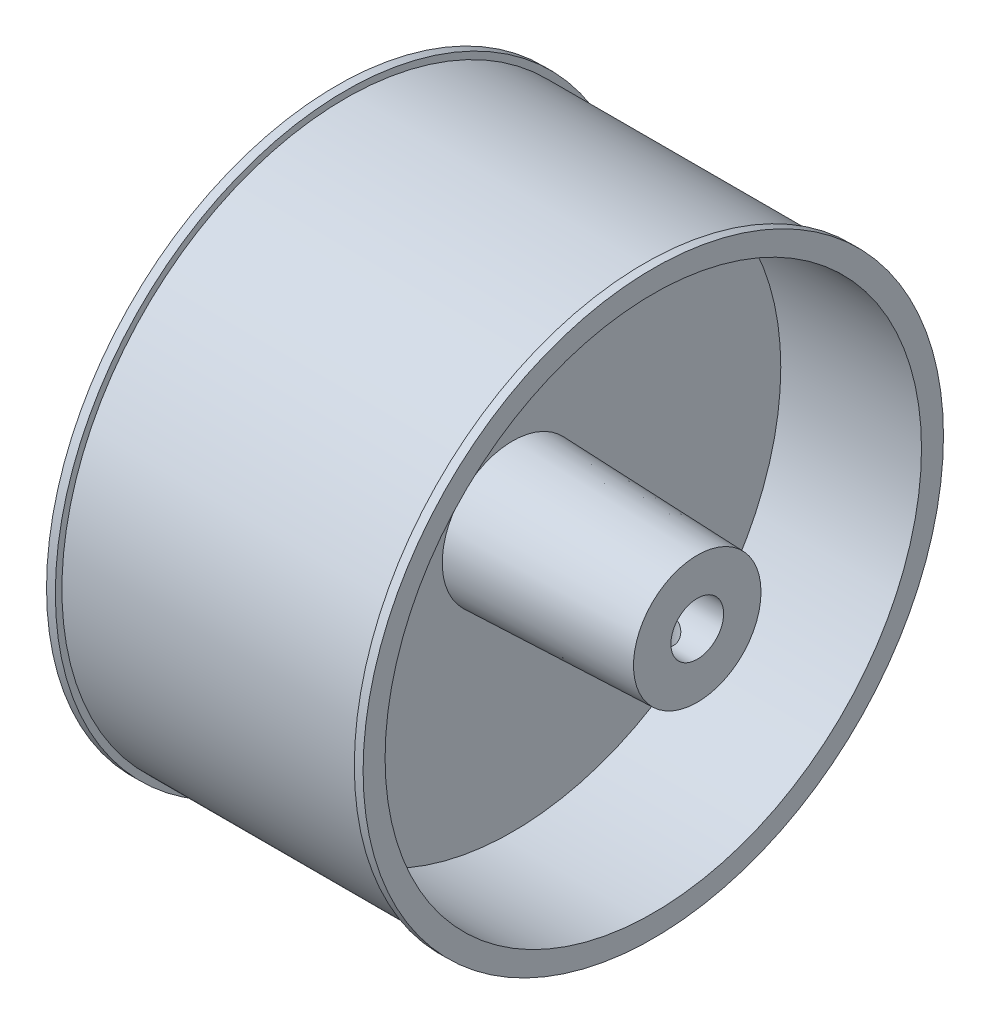
ISO-10303-21;
HEADER;
FILE_DESCRIPTION(('STEP AP214'),'2;1');
FILE_NAME('part.step','',(''),(''),'','','');
FILE_SCHEMA(('AUTOMOTIVE_DESIGN { 1 0 10303 214 1 1 1 1 }'));
ENDSEC;
DATA;
#1=APPLICATION_CONTEXT('core data for automotive mechanical design processes');
#2=APPLICATION_PROTOCOL_DEFINITION('international standard','automotive_design',2000,#1);
#3=PRODUCT_CONTEXT('',#1,'mechanical');
#4=PRODUCT('Part','Part','',(#3));
#5=PRODUCT_RELATED_PRODUCT_CATEGORY('part','',(#4));
#6=PRODUCT_DEFINITION_FORMATION('','',#4);
#7=PRODUCT_DEFINITION_CONTEXT('part definition',#1,'design');
#8=PRODUCT_DEFINITION('design','',#6,#7);
#9=PRODUCT_DEFINITION_SHAPE('','',#8);
#10=(LENGTH_UNIT() NAMED_UNIT(*) SI_UNIT(.MILLI.,.METRE.));
#11=(NAMED_UNIT(*) PLANE_ANGLE_UNIT() SI_UNIT($,.RADIAN.));
#12=(NAMED_UNIT(*) SI_UNIT($,.STERADIAN.) SOLID_ANGLE_UNIT());
#13=UNCERTAINTY_MEASURE_WITH_UNIT(LENGTH_MEASURE(1.E-05),#10,'distance_accuracy_value','');
#14=(GEOMETRIC_REPRESENTATION_CONTEXT(3) GLOBAL_UNCERTAINTY_ASSIGNED_CONTEXT((#13)) GLOBAL_UNIT_ASSIGNED_CONTEXT((#10,
#11,#12)) REPRESENTATION_CONTEXT('',''));
#15=CARTESIAN_POINT('',(0.,0.,0.));
#16=DIRECTION('',(0.,0.,1.));
#17=DIRECTION('',(1.,0.,0.));
#18=AXIS2_PLACEMENT_3D('',#15,#16,#17);
#19=CARTESIAN_POINT('',(36.,0.,0.));
#20=DIRECTION('',(-1.,0.,0.));
#21=DIRECTION('',(0.,0.,1.));
#22=AXIS2_PLACEMENT_3D('',#19,#20,#21);
#23=CYLINDRICAL_SURFACE('',#22,33.);
#24=CARTESIAN_POINT('',(0.,0.,0.));
#25=DIRECTION('',(1.,0.,0.));
#26=DIRECTION('',(0.,0.,-1.));
#27=AXIS2_PLACEMENT_3D('',#24,#25,#26);
#28=CIRCLE('',#27,33.);
#29=CARTESIAN_POINT('',(0.,0.,-33.));
#30=VERTEX_POINT('',#29);
#31=EDGE_CURVE('E52',#30,#30,#28,.T.);
#32=ORIENTED_EDGE('',*,*,#31,.T.);
#33=EDGE_LOOP('',(#32));
#34=FACE_BOUND('',#33,.T.);
#35=CARTESIAN_POINT('',(1.00000000000001,0.,0.));
#36=DIRECTION('',(1.,0.,0.));
#37=DIRECTION('',(0.,0.,-1.));
#38=AXIS2_PLACEMENT_3D('',#35,#36,#37);
#39=CIRCLE('',#38,33.);
#40=CARTESIAN_POINT('',(1.00000000000001,0.,-33.));
#41=VERTEX_POINT('',#40);
#42=EDGE_CURVE('E68',#41,#41,#39,.T.);
#43=ORIENTED_EDGE('',*,*,#42,.F.);
#44=EDGE_LOOP('',(#43));
#45=FACE_BOUND('',#44,.T.);
#46=ADVANCED_FACE('F39',(#34,#45),#23,.T.);
#47=CARTESIAN_POINT('',(20.,0.,0.));
#48=DIRECTION('',(1.,0.,0.));
#49=DIRECTION('',(0.,0.,-1.));
#50=AXIS2_PLACEMENT_3D('',#47,#48,#49);
#51=PLANE('',#50);
#52=CARTESIAN_POINT('',(20.,0.,0.));
#53=DIRECTION('',(1.,0.,0.));
#54=DIRECTION('',(0.,0.,-1.));
#55=AXIS2_PLACEMENT_3D('',#52,#53,#54);
#56=CIRCLE('',#55,30.5);
#57=CARTESIAN_POINT('',(20.,0.,-30.5));
#58=VERTEX_POINT('',#57);
#59=EDGE_CURVE('E57',#58,#58,#56,.T.);
#60=ORIENTED_EDGE('',*,*,#59,.T.);
#61=EDGE_LOOP('',(#60));
#62=FACE_BOUND('',#61,.T.);
#63=CARTESIAN_POINT('',(20.,0.,0.));
#64=DIRECTION('',(1.,0.,0.));
#65=DIRECTION('',(0.,0.,-1.));
#66=AXIS2_PLACEMENT_3D('',#63,#64,#65);
#67=CIRCLE('',#66,8.);
#68=CARTESIAN_POINT('',(20.,0.,-8.));
#69=VERTEX_POINT('',#68);
#70=EDGE_CURVE('E185',#69,#69,#67,.T.);
#71=ORIENTED_EDGE('',*,*,#70,.F.);
#72=EDGE_LOOP('',(#71));
#73=FACE_BOUND('',#72,.T.);
#74=ADVANCED_FACE('F112',(#62,#73),#51,.T.);
#75=CARTESIAN_POINT('',(35.,0.,0.));
#76=DIRECTION('',(1.,0.,0.));
#77=DIRECTION('',(0.,0.,-1.));
#78=AXIS2_PLACEMENT_3D('',#75,#76,#77);
#79=CIRCLE('',#78,33.);
#80=CARTESIAN_POINT('',(35.,0.,-33.));
#81=VERTEX_POINT('',#80);
#82=EDGE_CURVE('E70',#81,#81,#79,.T.);
#83=ORIENTED_EDGE('',*,*,#82,.T.);
#84=EDGE_LOOP('',(#83));
#85=FACE_BOUND('',#84,.T.);
#86=CARTESIAN_POINT('',(36.,0.,0.));
#87=DIRECTION('',(1.,0.,0.));
#88=DIRECTION('',(0.,0.,-1.));
#89=AXIS2_PLACEMENT_3D('',#86,#87,#88);
#90=CIRCLE('',#89,33.);
#91=CARTESIAN_POINT('',(36.,0.,-33.));
#92=VERTEX_POINT('',#91);
#93=EDGE_CURVE('E11',#92,#92,#90,.T.);
#94=ORIENTED_EDGE('',*,*,#93,.F.);
#95=EDGE_LOOP('',(#94));
#96=FACE_BOUND('',#95,.T.);
#97=ADVANCED_FACE('F41',(#85,#96),#23,.T.);
#98=CARTESIAN_POINT('',(36.,0.,0.));
#99=DIRECTION('',(1.,0.,0.));
#100=DIRECTION('',(0.,0.,-1.));
#101=AXIS2_PLACEMENT_3D('',#98,#99,#100);
#102=PLANE('',#101);
#103=CARTESIAN_POINT('',(36.,0.,0.));
#104=DIRECTION('',(1.,0.,0.));
#105=DIRECTION('',(0.,0.,-1.));
#106=AXIS2_PLACEMENT_3D('',#103,#104,#105);
#107=CIRCLE('',#106,30.5);
#108=CARTESIAN_POINT('',(36.,0.,-30.5));
#109=VERTEX_POINT('',#108);
#110=EDGE_CURVE('E60',#109,#109,#107,.T.);
#111=ORIENTED_EDGE('',*,*,#110,.F.);
#112=EDGE_LOOP('',(#111));
#113=FACE_BOUND('',#112,.T.);
#114=ORIENTED_EDGE('',*,*,#93,.T.);
#115=EDGE_LOOP('',(#114));
#116=FACE_BOUND('',#115,.T.);
#117=ADVANCED_FACE('F161',(#113,#116),#102,.T.);
#118=CARTESIAN_POINT('',(0.,0.,0.));
#119=DIRECTION('',(1.,0.,0.));
#120=DIRECTION('',(0.,0.,-1.));
#121=AXIS2_PLACEMENT_3D('',#118,#119,#120);
#122=PLANE('',#121);
#123=CARTESIAN_POINT('',(0.,0.,0.));
#124=DIRECTION('',(-1.,0.,0.));
#125=DIRECTION('',(0.,0.,1.));
#126=AXIS2_PLACEMENT_3D('',#123,#124,#125);
#127=CIRCLE('',#126,30.5);
#128=CARTESIAN_POINT('',(0.,0.,30.5));
#129=VERTEX_POINT('',#128);
#130=EDGE_CURVE('E66',#129,#129,#127,.T.);
#131=ORIENTED_EDGE('',*,*,#130,.F.);
#132=EDGE_LOOP('',(#131));
#133=FACE_BOUND('',#132,.T.);
#134=ORIENTED_EDGE('',*,*,#31,.F.);
#135=EDGE_LOOP('',(#134));
#136=FACE_BOUND('',#135,.T.);
#137=ADVANCED_FACE('F165',(#133,#136),#122,.F.);
#138=CARTESIAN_POINT('',(20.,0.,0.));
#139=DIRECTION('',(1.,0.,0.));
#140=DIRECTION('',(0.,0.,-1.));
#141=AXIS2_PLACEMENT_3D('',#138,#139,#140);
#142=CYLINDRICAL_SURFACE('',#141,30.5);
#143=ORIENTED_EDGE('',*,*,#59,.F.);
#144=EDGE_LOOP('',(#143));
#145=FACE_BOUND('',#144,.T.);
#146=ORIENTED_EDGE('',*,*,#110,.T.);
#147=EDGE_LOOP('',(#146));
#148=FACE_BOUND('',#147,.T.);
#149=ADVANCED_FACE('F172',(#145,#148),#142,.F.);
#150=CARTESIAN_POINT('',(41.,0.,0.));
#151=DIRECTION('',(1.,0.,0.));
#152=DIRECTION('',(0.,0.,-1.));
#153=AXIS2_PLACEMENT_3D('',#150,#151,#152);
#154=PLANE('',#153);
#155=CARTESIAN_POINT('',(41.,0.,0.));
#156=DIRECTION('',(1.,0.,0.));
#157=DIRECTION('',(0.,0.,-1.));
#158=AXIS2_PLACEMENT_3D('',#155,#156,#157);
#159=CIRCLE('',#158,3.);
#160=CARTESIAN_POINT('',(41.,0.,-3.));
#161=VERTEX_POINT('',#160);
#162=EDGE_CURVE('E67',#161,#161,#159,.T.);
#163=ORIENTED_EDGE('',*,*,#162,.F.);
#164=EDGE_LOOP('',(#163));
#165=FACE_BOUND('',#164,.T.);
#166=CARTESIAN_POINT('',(41.,0.,0.));
#167=DIRECTION('',(1.,0.,0.));
#168=DIRECTION('',(0.,0.,-1.));
#169=AXIS2_PLACEMENT_3D('',#166,#167,#168);
#170=CIRCLE('',#169,7.25);
#171=CARTESIAN_POINT('',(41.,0.,-7.25));
#172=VERTEX_POINT('',#171);
#173=EDGE_CURVE('E85',#172,#172,#170,.T.);
#174=ORIENTED_EDGE('',*,*,#173,.T.);
#175=EDGE_LOOP('',(#174));
#176=FACE_BOUND('',#175,.T.);
#177=ADVANCED_FACE('F108',(#165,#176),#154,.T.);
#178=CARTESIAN_POINT('',(41.,0.,0.));
#179=DIRECTION('',(-1.,0.,0.));
#180=DIRECTION('',(0.,0.,1.));
#181=AXIS2_PLACEMENT_3D('',#178,#179,#180);
#182=CONICAL_SURFACE('',#181,7.25,0.035699112679324);
#183=CARTESIAN_POINT('',(34.9139115564366,-7.3268841127038,-1.44160988906889));
#184=CARTESIAN_POINT('',(34.9948900090352,-7.30861598708954,-1.51947725176473));
#185=CARTESIAN_POINT('',(35.0824370447478,-7.2901427519431,-1.59051065285746));
#186=CARTESIAN_POINT('',(35.2684326109351,-7.25456537198428,-1.71701499618818));
#187=CARTESIAN_POINT('',(35.3668859162037,-7.23746183251909,-1.77247908428625));
#188=CARTESIAN_POINT('',(35.5722624381081,-7.20627746632947,-1.86624681757191));
#189=CARTESIAN_POINT('',(35.6791953485028,-7.19220016939011,-1.90453047962079));
#190=CARTESIAN_POINT('',(35.8984437574527,-7.16847982027864,-1.96251120501883));
#191=CARTESIAN_POINT('',(36.010757415611,-7.15883526374885,-1.98221457643011));
#192=CARTESIAN_POINT('',(36.234487729188,-7.14503200926751,-2.00199067515956));
#193=CARTESIAN_POINT('',(36.3458521685961,-7.14073758861968,-2.00255902436107));
#194=CARTESIAN_POINT('',(36.5672048208931,-7.13737744289875,-1.98520099162515));
#195=CARTESIAN_POINT('',(36.6771931576546,-7.13831124375344,-1.96727628667704));
#196=CARTESIAN_POINT('',(36.8900573103031,-7.14487696168932,-1.91410979861814));
#197=CARTESIAN_POINT('',(36.9930382435504,-7.15040098549086,-1.8792732753205));
#198=CARTESIAN_POINT('',(37.1917959310996,-7.16506945829059,-1.7935306914625));
#199=CARTESIAN_POINT('',(37.2875718638659,-7.1742143194051,-1.74262280182576));
#200=CARTESIAN_POINT('',(37.4712459842188,-7.195042757657,-1.62503643080175));
#201=CARTESIAN_POINT('',(37.5589549648342,-7.20677220673199,-1.55807076414448));
#202=CARTESIAN_POINT('',(37.7221381110052,-7.2311188718154,-1.41072534736965));
#203=CARTESIAN_POINT('',(37.7976102365605,-7.24373623534585,-1.33034336514828));
#204=CARTESIAN_POINT('',(37.9362241686809,-7.26862415862599,-1.15590689073395));
#205=CARTESIAN_POINT('',(37.9989820785699,-7.28087640938999,-1.06154414538574));
#206=CARTESIAN_POINT('',(38.1077709342867,-7.30311159522505,-0.863374789968374));
#207=CARTESIAN_POINT('',(38.1538027929929,-7.31309465413347,-0.759568695687346));
#208=CARTESIAN_POINT('',(38.2274722841168,-7.32947572811639,-0.54610922783631));
#209=CARTESIAN_POINT('',(38.2552285757192,-7.33589682641893,-0.436498669023123));
#210=CARTESIAN_POINT('',(38.291896385012,-7.34444315671307,-0.214012195482852));
#211=CARTESIAN_POINT('',(38.3008111163139,-7.34656912127883,-0.101136840928129));
#212=CARTESIAN_POINT('',(38.299511627962,-7.34626227518808,0.12175215346645));
#213=CARTESIAN_POINT('',(38.2897553464874,-7.34393859865368,0.231768909293184));
#214=CARTESIAN_POINT('',(38.2523420042604,-7.33523028078987,0.448543185194616));
#215=CARTESIAN_POINT('',(38.2246848818088,-7.32884562546339,0.55530069403427));
#216=CARTESIAN_POINT('',(38.1523732119713,-7.31278765773064,0.762524963410352));
#217=CARTESIAN_POINT('',(38.1077315938733,-7.30311684747595,0.8629964415512));
#218=CARTESIAN_POINT('',(38.0027461466163,-7.28163295725973,1.05512201896952));
#219=CARTESIAN_POINT('',(37.9423998727728,-7.26981954385409,1.14677474241946));
#220=CARTESIAN_POINT('',(37.8059992822461,-7.24516501736984,1.3210077487828));
#221=CARTESIAN_POINT('',(37.7296036637146,-7.23230607757792,1.40331848008553));
#222=CARTESIAN_POINT('',(37.5640495904114,-7.20746446487947,1.55408781555251));
#223=CARTESIAN_POINT('',(37.4748900783777,-7.19548186468647,1.62254527108375));
#224=CARTESIAN_POINT('',(37.2852737654215,-7.17392819687785,1.74425037868202));
#225=CARTESIAN_POINT('',(37.184720680413,-7.16438030108843,1.79735248453316));
#226=CARTESIAN_POINT('',(36.9758201334215,-7.1493175645189,1.88583668956823));
#227=CARTESIAN_POINT('',(36.8674743969509,-7.14380183390528,1.92122269786426));
#228=CARTESIAN_POINT('',(36.6490354471215,-7.13791952035239,1.97245232768471));
#229=CARTESIAN_POINT('',(36.5390570524326,-7.1374253505198,1.98877079745188));
#230=CARTESIAN_POINT('',(36.318024688454,-7.14164930763689,2.0029834066819));
#231=CARTESIAN_POINT('',(36.2069708576032,-7.14636677231554,2.00087988689292));
#232=CARTESIAN_POINT('',(35.9893374454584,-7.16061338373864,1.97865967340648));
#233=CARTESIAN_POINT('',(35.8827128194809,-7.17004150636109,1.95891458784532));
#234=CARTESIAN_POINT('',(35.6744367513015,-7.19287000078473,1.90264996570584));
#235=CARTESIAN_POINT('',(35.5727859452872,-7.20627087919076,1.86612828945423));
#236=CARTESIAN_POINT('',(35.3749076089276,-7.23617318987544,1.77648746678696));
#237=CARTESIAN_POINT('',(35.2788428840379,-7.2527348874323,1.72302955956));
#238=CARTESIAN_POINT('',(35.0968957272299,-7.28723663166304,1.60127384801731));
#239=CARTESIAN_POINT('',(35.0110155943807,-7.3051769880547,1.53297270280907));
#240=CARTESIAN_POINT('',(34.8487120327183,-7.34142622850591,1.38059328831194));
#241=CARTESIAN_POINT('',(34.7727270746541,-7.35972590285937,1.29604486850646));
#242=CARTESIAN_POINT('',(34.6359852871381,-7.39425344652294,1.11503163347699));
#243=CARTESIAN_POINT('',(34.5752285028784,-7.41048130968454,1.01856678289032));
#244=CARTESIAN_POINT('',(34.4709364566969,-7.43919591516259,0.816533058482657));
#245=CARTESIAN_POINT('',(34.4273559406995,-7.45169246694206,0.710989012615881));
#246=CARTESIAN_POINT('',(34.3587084577977,-7.47169660194676,0.493600125926851));
#247=CARTESIAN_POINT('',(34.3336359468941,-7.47920567908252,0.381757182727269));
#248=CARTESIAN_POINT('',(34.3035281258553,-7.48825509820396,0.159517408594764));
#249=CARTESIAN_POINT('',(34.2977667673481,-7.4900116589328,0.0492274534452949));
#250=CARTESIAN_POINT('',(34.3044544854805,-7.48798749150251,-0.170746930384136));
#251=CARTESIAN_POINT('',(34.3169026292788,-7.48420704699454,-0.280431389793664));
#252=CARTESIAN_POINT('',(34.3591129313282,-7.47162381202368,-0.493783043294513));
#253=CARTESIAN_POINT('',(34.3885207166157,-7.4629238849697,-0.597526990417449));
#254=CARTESIAN_POINT('',(34.463394806931,-7.4414079411785,-0.798557498566907));
#255=CARTESIAN_POINT('',(34.5088574498348,-7.42859286317043,-0.895845526186385));
#256=CARTESIAN_POINT('',(34.6092228202151,-7.40144421783601,-1.07233502464459));
#257=CARTESIAN_POINT('',(34.6627397560524,-7.38738782305706,-1.15237317577051));
#258=CARTESIAN_POINT('',(34.780547642582,-7.35789886335915,-1.30380234104977));
#259=CARTESIAN_POINT('',(34.8448401411515,-7.34246610087833,-1.37519211034717));
#260=CARTESIAN_POINT('',(34.9139115564366,-7.3268841127038,-1.44160988906889));
#261=B_SPLINE_CURVE_WITH_KNOTS('',3,(#183,#184,#185,#186,#187,#188,#189,#190,#191,#192,#193,
#194,#195,#196,#197,#198,#199,#200,#201,#202,#203,#204,#205,#206,#207,#208,#209,#210,#211,#212,
#213,#214,#215,#216,#217,#218,#219,#220,#221,#222,#223,#224,#225,#226,#227,#228,#229,#230,#231,
#232,#233,#234,#235,#236,#237,#238,#239,#240,#241,#242,#243,#244,#245,#246,#247,#248,#249,#250,
#251,#252,#253,#254,#255,#256,#257,#258,#259,#260),.UNSPECIFIED.,.T.,.F.,(4,2,2,2,2,2,2,2,2,2,2,
2,2,2,2,2,2,2,2,2,2,2,2,2,2,2,2,2,2,2,2,2,2,2,2,2,2,2,4),(0.,0.341115530835921,
0.682380997631957,1.02404237959391,1.3655877247286,1.69827960467149,2.03094131806177,
2.35599793858456,2.68109156702846,3.01250133258373,3.34396629061855,3.68429906260903,
4.02461325704527,4.36269548816988,4.70072005142296,5.03056011046939,5.36040130638875,
5.6899919145567,6.019633859573,6.35716324586998,6.6947206066834,7.03537984235615,
7.37596387734283,7.7078720985591,8.03973814722464,8.36477428076175,8.68985188066868,
9.02189263723892,9.35400820656358,9.6977967971539,10.0415864079813,10.3844640872127,
10.7272390170784,11.0569726290376,11.3866893499081,11.7097541109545,12.0327452282569,
12.3236614510479,12.6146194989543),.UNSPECIFIED.);
#262=CARTESIAN_POINT('',(34.9139115564366,-7.3268841127038,-1.44160988906889));
#263=VERTEX_POINT('',#262);
#264=EDGE_CURVE('E116',#263,#263,#261,.T.);
#265=ORIENTED_EDGE('',*,*,#264,.F.);
#266=EDGE_LOOP('',(#265));
#267=FACE_BOUND('',#266,.T.);
#268=ORIENTED_EDGE('',*,*,#173,.F.);
#269=EDGE_LOOP('',(#268));
#270=FACE_BOUND('',#269,.T.);
#271=ORIENTED_EDGE('',*,*,#70,.T.);
#272=EDGE_LOOP('',(#271));
#273=FACE_BOUND('',#272,.T.);
#274=ADVANCED_FACE('F97',(#267,#270,#273),#182,.T.);
#275=CARTESIAN_POINT('',(18.,0.,0.));
#276=DIRECTION('',(-1.,0.,0.));
#277=DIRECTION('',(0.,0.,1.));
#278=AXIS2_PLACEMENT_3D('',#275,#276,#277);
#279=CYLINDRICAL_SURFACE('',#278,30.5);
#280=CARTESIAN_POINT('',(18.,0.,0.));
#281=DIRECTION('',(-1.,0.,0.));
#282=DIRECTION('',(0.,0.,1.));
#283=AXIS2_PLACEMENT_3D('',#280,#281,#282);
#284=CIRCLE('',#283,30.5);
#285=CARTESIAN_POINT('',(18.,0.,30.5));
#286=VERTEX_POINT('',#285);
#287=EDGE_CURVE('E82',#286,#286,#284,.T.);
#288=ORIENTED_EDGE('',*,*,#287,.F.);
#289=EDGE_LOOP('',(#288));
#290=FACE_BOUND('',#289,.T.);
#291=ORIENTED_EDGE('',*,*,#130,.T.);
#292=EDGE_LOOP('',(#291));
#293=FACE_BOUND('',#292,.T.);
#294=ADVANCED_FACE('F107',(#290,#293),#279,.F.);
#295=CARTESIAN_POINT('',(18.,0.,0.));
#296=DIRECTION('',(-1.,0.,0.));
#297=DIRECTION('',(0.,0.,1.));
#298=AXIS2_PLACEMENT_3D('',#295,#296,#297);
#299=PLANE('',#298);
#300=CARTESIAN_POINT('',(18.,0.,0.));
#301=DIRECTION('',(-1.,0.,0.));
#302=DIRECTION('',(0.,0.,1.));
#303=AXIS2_PLACEMENT_3D('',#300,#301,#302);
#304=CIRCLE('',#303,3.);
#305=CARTESIAN_POINT('',(18.,0.,3.));
#306=VERTEX_POINT('',#305);
#307=EDGE_CURVE('E63',#306,#306,#304,.T.);
#308=ORIENTED_EDGE('',*,*,#307,.F.);
#309=EDGE_LOOP('',(#308));
#310=FACE_BOUND('',#309,.T.);
#311=ORIENTED_EDGE('',*,*,#287,.T.);
#312=EDGE_LOOP('',(#311));
#313=FACE_BOUND('',#312,.T.);
#314=ADVANCED_FACE('F143',(#310,#313),#299,.T.);
#315=CARTESIAN_POINT('',(-36.,0.,0.));
#316=DIRECTION('',(1.,0.,0.));
#317=DIRECTION('',(0.,0.,-1.));
#318=AXIS2_PLACEMENT_3D('',#315,#316,#317);
#319=CYLINDRICAL_SURFACE('',#318,3.);
#320=CARTESIAN_POINT('',(36.30018747693,-2.23606797749979,2.));
#321=CARTESIAN_POINT('',(36.2025591660614,-2.23607753462816,1.99999453997731));
#322=CARTESIAN_POINT('',(36.1048967232212,-2.24258071047442,1.99278992503664));
#323=CARTESIAN_POINT('',(35.9130675652792,-2.26731972501617,1.96458268317731));
#324=CARTESIAN_POINT('',(35.8189074414005,-2.2855766081271,1.94355530587863));
#325=CARTESIAN_POINT('',(35.6374520350523,-2.3305658582557,1.88935861676632));
#326=CARTESIAN_POINT('',(35.5500997801924,-2.35721561794601,1.85630718014214));
#327=CARTESIAN_POINT('',(35.3823216445834,-2.41584094681825,1.77934008393539));
#328=CARTESIAN_POINT('',(35.3018972069536,-2.44781762158831,1.73542216812163));
#329=CARTESIAN_POINT('',(35.1365405893131,-2.51946072932026,1.63002410007714));
#330=CARTESIAN_POINT('',(35.0528553592128,-2.55954936090363,1.56687435451733));
#331=CARTESIAN_POINT('',(34.8961847680557,-2.63944827308082,1.4281921974068));
#332=CARTESIAN_POINT('',(34.8232099552715,-2.67925824297985,1.3526477317708));
#333=CARTESIAN_POINT('',(34.6795438181484,-2.76088818523747,1.17815690494296));
#334=CARTESIAN_POINT('',(34.6107049651544,-2.80216785846922,1.07740643965819));
#335=CARTESIAN_POINT('',(34.49154538144,-2.87558484482764,0.862470964212236));
#336=CARTESIAN_POINT('',(34.4412039628988,-2.90773236231037,0.748301152321706));
#337=CARTESIAN_POINT('',(34.3666310759126,-2.95599907464725,0.523249073480003));
#338=CARTESIAN_POINT('',(34.3401041324345,-2.97351175615867,0.413434725181416));
#339=CARTESIAN_POINT('',(34.3060029876464,-2.99609745461921,0.189695448729861));
#340=CARTESIAN_POINT('',(34.2984049177046,-3.00118613762359,0.0757758812858232));
#341=CARTESIAN_POINT('',(34.3023599268791,-2.99855361722953,-0.134147050232332));
#342=CARTESIAN_POINT('',(34.3111765282471,-2.99266264910127,-0.230240638008755));
#343=CARTESIAN_POINT('',(34.3422785282889,-2.9720818279002,-0.419238633271017));
#344=CARTESIAN_POINT('',(34.3645649092336,-2.95739133313102,-0.512142807649725));
#345=CARTESIAN_POINT('',(34.4213831617246,-2.92052091703736,-0.69207793767117));
#346=CARTESIAN_POINT('',(34.4558663621286,-2.89837077982679,-0.779130623845963));
#347=CARTESIAN_POINT('',(34.5357411198829,-2.84821104476287,-0.946209150653558));
#348=CARTESIAN_POINT('',(34.5811346684315,-2.82020037745161,-1.0262337049694));
#349=CARTESIAN_POINT('',(34.6881662143899,-2.75618058450702,-1.18828429196344));
#350=CARTESIAN_POINT('',(34.7511550002828,-2.71960408792025,-1.26919148099708));
#351=CARTESIAN_POINT('',(34.8880861564103,-2.64400601826998,-1.41998807498305));
#352=CARTESIAN_POINT('',(34.9620454228638,-2.60498072815232,-1.48986013519457));
#353=CARTESIAN_POINT('',(35.1321506871433,-2.52150044944151,-1.62772235326165));
#354=CARTESIAN_POINT('',(35.2299585566445,-2.47714320008931,-1.69373593126355));
#355=CARTESIAN_POINT('',(35.4376973161507,-2.39475610831095,-1.80834874945483));
#356=CARTESIAN_POINT('',(35.5476074713439,-2.35671571534889,-1.85697718654898));
#357=CARTESIAN_POINT('',(35.7449065390031,-2.30262870306889,-1.92332724567776));
#358=CARTESIAN_POINT('',(35.8297808469869,-2.28340364577667,-1.94590791747533));
#359=CARTESIAN_POINT('',(36.0032269667469,-2.25409039789612,-1.97979555580014));
#360=CARTESIAN_POINT('',(36.0917920881027,-2.24398636782354,-1.99112206964395));
#361=CARTESIAN_POINT('',(36.2706304633715,-2.23447556987372,-2.00179400148877));
#362=CARTESIAN_POINT('',(36.3609094554502,-2.23511533866469,-2.00108729753098));
#363=CARTESIAN_POINT('',(36.5398713108851,-2.24709880368953,-1.98761629716365));
#364=CARTESIAN_POINT('',(36.6285528210374,-2.2584511764885,-1.97484222690381));
#365=CARTESIAN_POINT('',(36.7975768944799,-2.28927977500747,-1.93899811187046));
#366=CARTESIAN_POINT('',(36.8781151859326,-2.30833187069749,-1.91646174529973));
#367=CARTESIAN_POINT('',(37.0343137129803,-2.35229958533651,-1.86223041628513));
#368=CARTESIAN_POINT('',(37.1099722998931,-2.3772171729463,-1.83053237805351));
#369=CARTESIAN_POINT('',(37.2703894807776,-2.43611483596194,-1.75163346599563));
#370=CARTESIAN_POINT('',(37.3539442884727,-2.47091081434317,-1.70260028818246));
#371=CARTESIAN_POINT('',(37.5126042795473,-2.54262514806634,-1.59352731501438));
#372=CARTESIAN_POINT('',(37.5876989936725,-2.57954604947544,-1.53347411883827));
#373=CARTESIAN_POINT('',(37.7441498243976,-2.66075678321007,-1.38876657712435));
#374=CARTESIAN_POINT('',(37.8232903251784,-2.70489452138573,-1.30160386514206));
#375=CARTESIAN_POINT('',(37.9660041598703,-2.78775581841638,-1.11309948866218));
#376=CARTESIAN_POINT('',(38.0295912481868,-2.82648414789458,-1.011770477457));
#377=CARTESIAN_POINT('',(38.1280792158476,-2.88790821242222,-0.817487474821792));
#378=CARTESIAN_POINT('',(38.1661439813704,-2.91225458111008,-0.726662364886314));
#379=CARTESIAN_POINT('',(38.2287946712505,-2.95278707867041,-0.538757079020509));
#380=CARTESIAN_POINT('',(38.2533919797898,-2.96898009871993,-0.441682263858764));
#381=CARTESIAN_POINT('',(38.2878844407688,-2.99178364026746,-0.243369392303439));
#382=CARTESIAN_POINT('',(38.2977141564367,-2.99835150856533,-0.142114836924314));
#383=CARTESIAN_POINT('',(38.3018353283471,-3.00109821029056,0.0608555465807365));
#384=CARTESIAN_POINT('',(38.2961282288862,-2.99727800938901,0.162571330953452));
#385=CARTESIAN_POINT('',(38.2705279879253,-2.98029555977323,0.35575753252811));
#386=CARTESIAN_POINT('',(38.2516964920682,-2.96783277209856,0.447435143070534));
#387=CARTESIAN_POINT('',(38.2019494674991,-2.93536106206933,0.626018422997066));
#388=CARTESIAN_POINT('',(38.1710320615828,-2.91535096747102,0.712923348686895));
#389=CARTESIAN_POINT('',(38.096248772046,-2.86791765486194,0.885147296608356));
#390=CARTESIAN_POINT('',(38.051737169435,-2.84013248946338,0.970083589200271));
#391=CARTESIAN_POINT('',(37.952036832304,-2.77975408235471,1.13155266268319));
#392=CARTESIAN_POINT('',(37.896841708978,-2.74715796645263,1.20808037205002));
#393=CARTESIAN_POINT('',(37.7675585745937,-2.67392931472394,1.36329422201403));
#394=CARTESIAN_POINT('',(37.691864453256,-2.6328391387737,1.44042679526092));
#395=CARTESIAN_POINT('',(37.5290739353842,-2.55053357649486,1.58160022281596));
#396=CARTESIAN_POINT('',(37.4419690880959,-2.50931811970154,1.64563128323924));
#397=CARTESIAN_POINT('',(37.2643198861747,-2.43384213590298,1.75513253518412));
#398=CARTESIAN_POINT('',(37.1745456669797,-2.39929086741903,1.80164646897211));
#399=CARTESIAN_POINT('',(36.9869030279369,-2.33747501591022,1.88115802340273));
#400=CARTESIAN_POINT('',(36.8890507830679,-2.31019631295304,1.91418190281334));
#401=CARTESIAN_POINT('',(36.7094160085055,-2.27191051929539,1.95936262470908));
#402=CARTESIAN_POINT('',(36.6288792401397,-2.25863695410151,1.97452228373249));
#403=CARTESIAN_POINT('',(36.4656310764255,-2.24071519216008,1.99483915818926));
#404=CARTESIAN_POINT('',(36.3829215326695,-2.23605987841475,2.00000462703716));
#405=CARTESIAN_POINT('',(36.30018747693,-2.23606797749979,2.));
#406=B_SPLINE_CURVE_WITH_KNOTS('',3,(#320,#321,#322,#323,#324,#325,#326,#327,#328,#329,#330,
#331,#332,#333,#334,#335,#336,#337,#338,#339,#340,#341,#342,#343,#344,#345,#346,#347,#348,#349,
#350,#351,#352,#353,#354,#355,#356,#357,#358,#359,#360,#361,#362,#363,#364,#365,#366,#367,#368,
#369,#370,#371,#372,#373,#374,#375,#376,#377,#378,#379,#380,#381,#382,#383,#384,#385,#386,#387,
#388,#389,#390,#391,#392,#393,#394,#395,#396,#397,#398,#399,#400,#401,#402,#403,#404,#405),
.UNSPECIFIED.,.T.,.F.,(4,2,2,2,2,2,2,2,2,2,2,2,2,2,2,2,2,2,2,2,2,2,2,2,2,2,2,2,2,2,2,2,2,2,2,2,
2,2,2,2,2,2,4),(0.,0.29250693072215,0.585539042259287,0.875772651216279,1.16606657266549,
1.50154677068638,1.83735518436275,2.2216703100629,2.6055542938858,2.9463748206358,
3.28676536688299,3.57539534955743,3.86404638283747,4.15155831973192,4.43912276903001,
4.76447525946635,5.09033414796639,5.46678703504945,5.84260469743949,6.11126090401327,
6.37944966235488,6.64880037638039,6.91836943570599,7.17476451706938,7.43124577644959,
7.73899230052354,8.04711556801511,8.42254684520965,8.79764490572583,9.100705806117,
9.40351012888474,9.70765229266166,10.0117661844615,10.2937678224973,10.5758132789284,
10.874178629859,11.1727229593109,11.5182220628452,11.8639785041861,12.1833412579672,
12.5020793664923,12.7501661630426,12.9980479966543),.UNSPECIFIED.);
#407=CARTESIAN_POINT('',(36.30018747693,-2.23606797749979,2.));
#408=VERTEX_POINT('',#407);
#409=EDGE_CURVE('E43',#408,#408,#406,.T.);
#410=ORIENTED_EDGE('',*,*,#409,.T.);
#411=EDGE_LOOP('',(#410));
#412=FACE_BOUND('',#411,.T.);
#413=ORIENTED_EDGE('',*,*,#307,.T.);
#414=EDGE_LOOP('',(#413));
#415=FACE_BOUND('',#414,.T.);
#416=ORIENTED_EDGE('',*,*,#162,.T.);
#417=EDGE_LOOP('',(#416));
#418=FACE_BOUND('',#417,.T.);
#419=ADVANCED_FACE('F138',(#412,#415,#418),#319,.F.);
#420=CARTESIAN_POINT('',(35.,0.,0.));
#421=DIRECTION('',(1.,0.,0.));
#422=DIRECTION('',(0.,0.,-1.));
#423=AXIS2_PLACEMENT_3D('',#420,#421,#422);
#424=PLANE('',#423);
#425=CARTESIAN_POINT('',(35.,0.,0.));
#426=DIRECTION('',(1.,0.,0.));
#427=DIRECTION('',(0.,0.,-1.));
#428=AXIS2_PLACEMENT_3D('',#425,#426,#427);
#429=CIRCLE('',#428,32.25);
#430=CARTESIAN_POINT('',(35.,0.,-32.25));
#431=VERTEX_POINT('',#430);
#432=EDGE_CURVE('E71',#431,#431,#429,.T.);
#433=ORIENTED_EDGE('',*,*,#432,.T.);
#434=EDGE_LOOP('',(#433));
#435=FACE_BOUND('',#434,.T.);
#436=ORIENTED_EDGE('',*,*,#82,.F.);
#437=EDGE_LOOP('',(#436));
#438=FACE_BOUND('',#437,.T.);
#439=ADVANCED_FACE('F132',(#435,#438),#424,.F.);
#440=CARTESIAN_POINT('',(1.00000000000001,0.,0.));
#441=DIRECTION('',(1.,0.,0.));
#442=DIRECTION('',(0.,0.,-1.));
#443=AXIS2_PLACEMENT_3D('',#440,#441,#442);
#444=PLANE('',#443);
#445=CARTESIAN_POINT('',(1.00000000000001,0.,0.));
#446=DIRECTION('',(1.,0.,0.));
#447=DIRECTION('',(0.,0.,-1.));
#448=AXIS2_PLACEMENT_3D('',#445,#446,#447);
#449=CIRCLE('',#448,32.25);
#450=CARTESIAN_POINT('',(1.00000000000001,0.,-32.25));
#451=VERTEX_POINT('',#450);
#452=EDGE_CURVE('E121',#451,#451,#449,.T.);
#453=ORIENTED_EDGE('',*,*,#452,.F.);
#454=EDGE_LOOP('',(#453));
#455=FACE_BOUND('',#454,.T.);
#456=ORIENTED_EDGE('',*,*,#42,.T.);
#457=EDGE_LOOP('',(#456));
#458=FACE_BOUND('',#457,.T.);
#459=ADVANCED_FACE('F128',(#455,#458),#444,.T.);
#460=CARTESIAN_POINT('',(35.,0.,0.));
#461=DIRECTION('',(-1.,0.,0.));
#462=DIRECTION('',(0.,0.,1.));
#463=AXIS2_PLACEMENT_3D('',#460,#461,#462);
#464=CYLINDRICAL_SURFACE('',#463,32.25);
#465=ORIENTED_EDGE('',*,*,#432,.F.);
#466=EDGE_LOOP('',(#465));
#467=FACE_BOUND('',#466,.T.);
#468=ORIENTED_EDGE('',*,*,#452,.T.);
#469=EDGE_LOOP('',(#468));
#470=FACE_BOUND('',#469,.T.);
#471=ADVANCED_FACE('F126',(#467,#470),#464,.T.);
#472=CARTESIAN_POINT('',(36.30018747693,-17.,0.));
#473=DIRECTION('',(0.,1.,0.));
#474=DIRECTION('',(0.,0.,1.));
#475=AXIS2_PLACEMENT_3D('',#472,#473,#474);
#476=CYLINDRICAL_SURFACE('',#475,2.);
#477=ORIENTED_EDGE('',*,*,#264,.T.);
#478=EDGE_LOOP('',(#477));
#479=FACE_BOUND('',#478,.T.);
#480=ORIENTED_EDGE('',*,*,#409,.F.);
#481=EDGE_LOOP('',(#480));
#482=FACE_BOUND('',#481,.T.);
#483=ADVANCED_FACE('F122',(#479,#482),#476,.F.);
#484=CLOSED_SHELL('',(#46,#74,#97,#117,#137,#149,#177,#274,#294,#314,#419,#439,#459,#471,#483));
#485=MANIFOLD_SOLID_BREP('B2',#484);
#486=ADVANCED_BREP_SHAPE_REPRESENTATION('',(#18,#485),#14);
#487=SHAPE_DEFINITION_REPRESENTATION(#9,#486);
ENDSEC;
END-ISO-10303-21;
